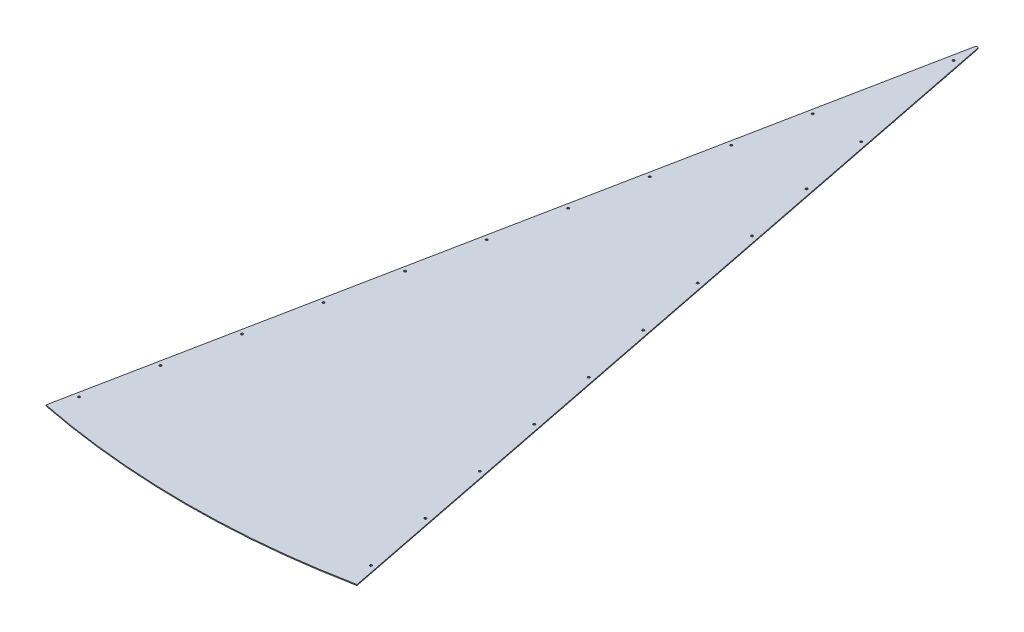
ISO-10303-21;
HEADER;
FILE_DESCRIPTION(('STEP AP214'),'2;1');
FILE_NAME('part.step','',(''),(''),'','','');
FILE_SCHEMA(('AUTOMOTIVE_DESIGN { 1 0 10303 214 1 1 1 1 }'));
ENDSEC;
DATA;
#1=APPLICATION_CONTEXT('core data for automotive mechanical design processes');
#2=APPLICATION_PROTOCOL_DEFINITION('international standard','automotive_design',2000,#1);
#3=PRODUCT_CONTEXT('',#1,'mechanical');
#4=PRODUCT('Part','Part','',(#3));
#5=PRODUCT_RELATED_PRODUCT_CATEGORY('part','',(#4));
#6=PRODUCT_DEFINITION_FORMATION('','',#4);
#7=PRODUCT_DEFINITION_CONTEXT('part definition',#1,'design');
#8=PRODUCT_DEFINITION('design','',#6,#7);
#9=PRODUCT_DEFINITION_SHAPE('','',#8);
#10=(LENGTH_UNIT() NAMED_UNIT(*) SI_UNIT(.MILLI.,.METRE.));
#11=(NAMED_UNIT(*) PLANE_ANGLE_UNIT() SI_UNIT($,.RADIAN.));
#12=(NAMED_UNIT(*) SI_UNIT($,.STERADIAN.) SOLID_ANGLE_UNIT());
#13=UNCERTAINTY_MEASURE_WITH_UNIT(LENGTH_MEASURE(1.E-05),#10,'distance_accuracy_value','');
#14=(GEOMETRIC_REPRESENTATION_CONTEXT(3) GLOBAL_UNCERTAINTY_ASSIGNED_CONTEXT((#13)) GLOBAL_UNIT_ASSIGNED_CONTEXT((#10,
#11,#12)) REPRESENTATION_CONTEXT('',''));
#15=CARTESIAN_POINT('',(0.,0.,0.));
#16=DIRECTION('',(0.,0.,1.));
#17=DIRECTION('',(1.,0.,0.));
#18=AXIS2_PLACEMENT_3D('',#15,#16,#17);
#19=CARTESIAN_POINT('',(0.,2.5,0.));
#20=DIRECTION('',(0.,-1.,0.));
#21=DIRECTION('',(0.,0.,-1.));
#22=AXIS2_PLACEMENT_3D('',#19,#20,#21);
#23=CYLINDRICAL_SURFACE('',#22,2150.);
#24=CARTESIAN_POINT('',(0.,0.,0.));
#25=DIRECTION('',(0.,1.,0.));
#26=DIRECTION('',(0.,0.,1.));
#27=AXIS2_PLACEMENT_3D('',#24,#25,#26);
#28=CIRCLE('',#27,2150.);
#29=CARTESIAN_POINT('',(-419.444192334677,0.,2108.68835286695));
#30=VERTEX_POINT('',#29);
#31=CARTESIAN_POINT('',(419.444192334677,0.,2108.68835286695));
#32=VERTEX_POINT('',#31);
#33=EDGE_CURVE('E97',#30,#32,#28,.T.);
#34=ORIENTED_EDGE('',*,*,#33,.T.);
#35=DIRECTION('',(0.,-1.,0.));
#36=VECTOR('',#35,1.);
#37=CARTESIAN_POINT('',(419.444192334677,2.5,2108.68835286695));
#38=LINE('',#37,#36);
#39=CARTESIAN_POINT('',(419.444192334677,2.5,2108.68835286695));
#40=VERTEX_POINT('',#39);
#41=EDGE_CURVE('E11',#40,#32,#38,.T.);
#42=ORIENTED_EDGE('',*,*,#41,.F.);
#43=CARTESIAN_POINT('',(0.,2.5,0.));
#44=DIRECTION('',(0.,1.,0.));
#45=DIRECTION('',(0.,0.,1.));
#46=AXIS2_PLACEMENT_3D('',#43,#44,#45);
#47=CIRCLE('',#46,2150.);
#48=CARTESIAN_POINT('',(-419.444192334677,2.5,2108.68835286695));
#49=VERTEX_POINT('',#48);
#50=EDGE_CURVE('E85',#49,#40,#47,.T.);
#51=ORIENTED_EDGE('',*,*,#50,.F.);
#52=DIRECTION('',(0.,-1.,0.));
#53=VECTOR('',#52,1.);
#54=CARTESIAN_POINT('',(-419.444192334677,2.5,2108.68835286695));
#55=LINE('',#54,#53);
#56=EDGE_CURVE('E93',#49,#30,#55,.T.);
#57=ORIENTED_EDGE('',*,*,#56,.T.);
#58=EDGE_LOOP('',(#34,#42,#51,#57));
#59=FACE_BOUND('',#58,.T.);
#60=ADVANCED_FACE('F34',(#59),#23,.T.);
#61=CARTESIAN_POINT('',(3.76904625396577,2.5,18.9482750802111));
#62=DIRECTION('',(-0.98078528040323,0.,0.195090322016129));
#63=DIRECTION('',(0.195090322016129,0.,0.98078528040323));
#64=AXIS2_PLACEMENT_3D('',#61,#62,#63);
#65=PLANE('',#64);
#66=DIRECTION('',(-0.195090322016129,0.,-0.98078528040323));
#67=VECTOR('',#66,1.);
#68=CARTESIAN_POINT('',(3.76904625396577,0.,18.9482750802111));
#69=LINE('',#68,#67);
#70=CARTESIAN_POINT('',(3.76904625396577,0.,18.9482750802111));
#71=VERTEX_POINT('',#70);
#72=EDGE_CURVE('E89',#32,#71,#69,.T.);
#73=ORIENTED_EDGE('',*,*,#72,.T.);
#74=DIRECTION('',(0.,-1.,0.));
#75=VECTOR('',#74,1.);
#76=CARTESIAN_POINT('',(3.76904625396577,2.5,18.9482750802111));
#77=LINE('',#76,#75);
#78=CARTESIAN_POINT('',(3.76904625396577,2.5,18.9482750802111));
#79=VERTEX_POINT('',#78);
#80=EDGE_CURVE('E42',#79,#71,#77,.T.);
#81=ORIENTED_EDGE('',*,*,#80,.F.);
#82=DIRECTION('',(-0.195090322016129,0.,-0.98078528040323));
#83=VECTOR('',#82,1.);
#84=CARTESIAN_POINT('',(3.76904625396577,2.5,18.9482750802111));
#85=LINE('',#84,#83);
#86=EDGE_CURVE('E80',#40,#79,#85,.T.);
#87=ORIENTED_EDGE('',*,*,#86,.F.);
#88=ORIENTED_EDGE('',*,*,#41,.T.);
#89=EDGE_LOOP('',(#73,#81,#87,#88));
#90=FACE_BOUND('',#89,.T.);
#91=ADVANCED_FACE('F88',(#90),#65,.F.);
#92=CARTESIAN_POINT('',(0.,2.5,20.));
#93=DIRECTION('',(0.,-1.,0.));
#94=DIRECTION('',(0.,0.,-1.));
#95=AXIS2_PLACEMENT_3D('',#92,#93,#94);
#96=CYLINDRICAL_SURFACE('',#95,3.91303398546939);
#97=CARTESIAN_POINT('',(0.,0.,20.));
#98=DIRECTION('',(0.,1.,0.));
#99=DIRECTION('',(0.,0.,-1.));
#100=AXIS2_PLACEMENT_3D('',#97,#98,#99);
#101=CIRCLE('',#100,3.91303398546939);
#102=CARTESIAN_POINT('',(-3.76904625396577,0.,18.9482750802111));
#103=VERTEX_POINT('',#102);
#104=EDGE_CURVE('E67',#71,#103,#101,.T.);
#105=ORIENTED_EDGE('',*,*,#104,.T.);
#106=DIRECTION('',(0.,-1.,0.));
#107=VECTOR('',#106,1.);
#108=CARTESIAN_POINT('',(-3.76904625396577,2.5,18.9482750802111));
#109=LINE('',#108,#107);
#110=CARTESIAN_POINT('',(-3.76904625396577,2.5,18.9482750802111));
#111=VERTEX_POINT('',#110);
#112=EDGE_CURVE('E90',#111,#103,#109,.T.);
#113=ORIENTED_EDGE('',*,*,#112,.F.);
#114=CARTESIAN_POINT('',(0.,2.5,20.));
#115=DIRECTION('',(0.,1.,0.));
#116=DIRECTION('',(0.,0.,-1.));
#117=AXIS2_PLACEMENT_3D('',#114,#115,#116);
#118=CIRCLE('',#117,3.91303398546939);
#119=EDGE_CURVE('E83',#79,#111,#118,.T.);
#120=ORIENTED_EDGE('',*,*,#119,.F.);
#121=ORIENTED_EDGE('',*,*,#80,.T.);
#122=EDGE_LOOP('',(#105,#113,#120,#121));
#123=FACE_BOUND('',#122,.T.);
#124=ADVANCED_FACE('F91',(#123),#96,.T.);
#125=CARTESIAN_POINT('',(-3.76904625396577,2.5,18.9482750802111));
#126=DIRECTION('',(0.98078528040323,0.,0.195090322016129));
#127=DIRECTION('',(0.195090322016129,0.,-0.98078528040323));
#128=AXIS2_PLACEMENT_3D('',#125,#126,#127);
#129=PLANE('',#128);
#130=DIRECTION('',(-0.195090322016129,0.,0.98078528040323));
#131=VECTOR('',#130,1.);
#132=CARTESIAN_POINT('',(-3.76904625396577,0.,18.9482750802111));
#133=LINE('',#132,#131);
#134=EDGE_CURVE('E73',#103,#30,#133,.T.);
#135=ORIENTED_EDGE('',*,*,#134,.T.);
#136=ORIENTED_EDGE('',*,*,#56,.F.);
#137=DIRECTION('',(-0.195090322016129,0.,0.98078528040323));
#138=VECTOR('',#137,1.);
#139=CARTESIAN_POINT('',(-3.76904625396577,2.5,18.9482750802111));
#140=LINE('',#139,#138);
#141=EDGE_CURVE('E50',#111,#49,#140,.T.);
#142=ORIENTED_EDGE('',*,*,#141,.F.);
#143=ORIENTED_EDGE('',*,*,#112,.T.);
#144=EDGE_LOOP('',(#135,#136,#142,#143));
#145=FACE_BOUND('',#144,.T.);
#146=ADVANCED_FACE('F105',(#145),#129,.F.);
#147=CARTESIAN_POINT('',(0.,2.5,0.));
#148=DIRECTION('',(0.,1.,0.));
#149=DIRECTION('',(0.,0.,1.));
#150=AXIS2_PLACEMENT_3D('',#147,#148,#149);
#151=PLANE('',#150);
#152=CARTESIAN_POINT('',(-393.622932114354,2.5,2045.51191326614));
#153=DIRECTION('',(0.,1.,0.));
#154=DIRECTION('',(0.,0.,1.));
#155=AXIS2_PLACEMENT_3D('',#152,#153,#154);
#156=CIRCLE('',#155,2.99999999999972);
#157=CARTESIAN_POINT('',(-393.622932114354,2.5,2048.51191326614));
#158=VERTEX_POINT('',#157);
#159=EDGE_CURVE('E206',#158,#158,#156,.T.);
#160=ORIENTED_EDGE('',*,*,#159,.F.);
#161=EDGE_LOOP('',(#160));
#162=FACE_BOUND('',#161,.T.);
#163=CARTESIAN_POINT('',(320.659151680324,2.5,1678.69821839533));
#164=DIRECTION('',(0.,1.,0.));
#165=DIRECTION('',(0.,0.,-1.));
#166=AXIS2_PLACEMENT_3D('',#163,#164,#165);
#167=CIRCLE('',#166,2.99999999999989);
#168=CARTESIAN_POINT('',(320.659151680324,2.5,1675.69821839533));
#169=VERTEX_POINT('',#168);
#170=EDGE_CURVE('E212',#169,#169,#167,.T.);
#171=ORIENTED_EDGE('',*,*,#170,.F.);
#172=EDGE_LOOP('',(#171));
#173=FACE_BOUND('',#172,.T.);
#174=CARTESIAN_POINT('',(357.141041897339,2.5,1862.10506583073));
#175=DIRECTION('',(0.,1.,0.));
#176=DIRECTION('',(0.,0.,-1.));
#177=AXIS2_PLACEMENT_3D('',#174,#175,#176);
#178=CIRCLE('',#177,2.99999999999989);
#179=CARTESIAN_POINT('',(357.141041897339,2.5,1859.10506583073));
#180=VERTEX_POINT('',#179);
#181=EDGE_CURVE('E213',#180,#180,#178,.T.);
#182=ORIENTED_EDGE('',*,*,#181,.F.);
#183=EDGE_LOOP('',(#182));
#184=FACE_BOUND('',#183,.T.);
#185=CARTESIAN_POINT('',(393.622932114355,2.5,2045.51191326614));
#186=DIRECTION('',(0.,1.,0.));
#187=DIRECTION('',(0.,0.,-1.));
#188=AXIS2_PLACEMENT_3D('',#185,#186,#187);
#189=CIRCLE('',#188,2.99999999999972);
#190=CARTESIAN_POINT('',(393.622932114355,2.5,2042.51191326614));
#191=VERTEX_POINT('',#190);
#192=EDGE_CURVE('E224',#191,#191,#189,.T.);
#193=ORIENTED_EDGE('',*,*,#192,.F.);
#194=EDGE_LOOP('',(#193));
#195=FACE_BOUND('',#194,.T.);
#196=CARTESIAN_POINT('',(0.,2.5,80.));
#197=DIRECTION('',(0.,1.,0.));
#198=DIRECTION('',(0.,0.,1.));
#199=AXIS2_PLACEMENT_3D('',#196,#197,#198);
#200=CIRCLE('',#199,3.);
#201=CARTESIAN_POINT('',(0.,2.5,83.));
#202=VERTEX_POINT('',#201);
#203=EDGE_CURVE('E225',#202,#202,#200,.T.);
#204=ORIENTED_EDGE('',*,*,#203,.F.);
#205=EDGE_LOOP('',(#204));
#206=FACE_BOUND('',#205,.T.);
#207=CARTESIAN_POINT('',(284.177261463308,2.5,1495.29137095993));
#208=DIRECTION('',(0.,1.,0.));
#209=DIRECTION('',(0.,0.,-1.));
#210=AXIS2_PLACEMENT_3D('',#207,#208,#209);
#211=CIRCLE('',#210,2.99999999999989);
#212=CARTESIAN_POINT('',(284.177261463308,2.5,1492.29137095993));
#213=VERTEX_POINT('',#212);
#214=EDGE_CURVE('E115',#213,#213,#211,.T.);
#215=ORIENTED_EDGE('',*,*,#214,.F.);
#216=EDGE_LOOP('',(#215));
#217=FACE_BOUND('',#216,.T.);
#218=CARTESIAN_POINT('',(247.695371246293,2.5,1311.88452352452));
#219=DIRECTION('',(0.,1.,0.));
#220=DIRECTION('',(0.,0.,-1.));
#221=AXIS2_PLACEMENT_3D('',#218,#219,#220);
#222=CIRCLE('',#221,2.99999999999986);
#223=CARTESIAN_POINT('',(247.695371246293,2.5,1308.88452352452));
#224=VERTEX_POINT('',#223);
#225=EDGE_CURVE('E114',#224,#224,#222,.T.);
#226=ORIENTED_EDGE('',*,*,#225,.F.);
#227=EDGE_LOOP('',(#226));
#228=FACE_BOUND('',#227,.T.);
#229=CARTESIAN_POINT('',(211.213481029277,2.5,1128.47767608912));
#230=DIRECTION('',(0.,1.,0.));
#231=DIRECTION('',(0.,0.,-1.));
#232=AXIS2_PLACEMENT_3D('',#229,#230,#231);
#233=CIRCLE('',#232,2.99999999999989);
#234=CARTESIAN_POINT('',(211.213481029277,2.5,1125.47767608912));
#235=VERTEX_POINT('',#234);
#236=EDGE_CURVE('E122',#235,#235,#233,.T.);
#237=ORIENTED_EDGE('',*,*,#236,.F.);
#238=EDGE_LOOP('',(#237));
#239=FACE_BOUND('',#238,.T.);
#240=CARTESIAN_POINT('',(174.731590812262,2.5,945.070828653713));
#241=DIRECTION('',(0.,1.,0.));
#242=DIRECTION('',(0.,0.,-1.));
#243=AXIS2_PLACEMENT_3D('',#240,#241,#242);
#244=CIRCLE('',#243,2.99999999999989);
#245=CARTESIAN_POINT('',(174.731590812262,2.5,942.070828653713));
#246=VERTEX_POINT('',#245);
#247=EDGE_CURVE('E128',#246,#246,#244,.T.);
#248=ORIENTED_EDGE('',*,*,#247,.F.);
#249=EDGE_LOOP('',(#248));
#250=FACE_BOUND('',#249,.T.);
#251=CARTESIAN_POINT('',(138.249700595246,2.5,761.663981218309));
#252=DIRECTION('',(0.,1.,0.));
#253=DIRECTION('',(0.,0.,-1.));
#254=AXIS2_PLACEMENT_3D('',#251,#252,#253);
#255=CIRCLE('',#254,2.99999999999992);
#256=CARTESIAN_POINT('',(138.249700595246,2.5,758.663981218309));
#257=VERTEX_POINT('',#256);
#258=EDGE_CURVE('E134',#257,#257,#255,.T.);
#259=ORIENTED_EDGE('',*,*,#258,.F.);
#260=EDGE_LOOP('',(#259));
#261=FACE_BOUND('',#260,.T.);
#262=CARTESIAN_POINT('',(101.767810378231,2.5,578.257133782905));
#263=DIRECTION('',(0.,1.,0.));
#264=DIRECTION('',(0.,0.,-1.));
#265=AXIS2_PLACEMENT_3D('',#262,#263,#264);
#266=CIRCLE('',#265,2.99999999999993);
#267=CARTESIAN_POINT('',(101.767810378231,2.5,575.257133782905));
#268=VERTEX_POINT('',#267);
#269=EDGE_CURVE('E140',#268,#268,#266,.T.);
#270=ORIENTED_EDGE('',*,*,#269,.F.);
#271=EDGE_LOOP('',(#270));
#272=FACE_BOUND('',#271,.T.);
#273=CARTESIAN_POINT('',(65.2859201612153,2.5,394.850286347501));
#274=DIRECTION('',(0.,1.,0.));
#275=DIRECTION('',(0.,0.,-1.));
#276=AXIS2_PLACEMENT_3D('',#273,#274,#275);
#277=CIRCLE('',#276,2.99999999999986);
#278=CARTESIAN_POINT('',(65.2859201612153,2.5,391.850286347501));
#279=VERTEX_POINT('',#278);
#280=EDGE_CURVE('E146',#279,#279,#277,.T.);
#281=ORIENTED_EDGE('',*,*,#280,.F.);
#282=EDGE_LOOP('',(#281));
#283=FACE_BOUND('',#282,.T.);
#284=CARTESIAN_POINT('',(-65.2859201612153,2.5,394.850286347501));
#285=DIRECTION('',(0.,1.,0.));
#286=DIRECTION('',(0.,0.,1.));
#287=AXIS2_PLACEMENT_3D('',#284,#285,#286);
#288=CIRCLE('',#287,2.99999999999984);
#289=CARTESIAN_POINT('',(-65.2859201612153,2.5,397.8502863475));
#290=VERTEX_POINT('',#289);
#291=EDGE_CURVE('E152',#290,#290,#288,.T.);
#292=ORIENTED_EDGE('',*,*,#291,.F.);
#293=EDGE_LOOP('',(#292));
#294=FACE_BOUND('',#293,.T.);
#295=CARTESIAN_POINT('',(-101.767810378231,2.5,578.257133782905));
#296=DIRECTION('',(0.,1.,0.));
#297=DIRECTION('',(0.,0.,1.));
#298=AXIS2_PLACEMENT_3D('',#295,#296,#297);
#299=CIRCLE('',#298,2.99999999999993);
#300=CARTESIAN_POINT('',(-101.767810378231,2.5,581.257133782905));
#301=VERTEX_POINT('',#300);
#302=EDGE_CURVE('E158',#301,#301,#299,.T.);
#303=ORIENTED_EDGE('',*,*,#302,.F.);
#304=EDGE_LOOP('',(#303));
#305=FACE_BOUND('',#304,.T.);
#306=CARTESIAN_POINT('',(-138.249700595246,2.5,761.663981218309));
#307=DIRECTION('',(0.,1.,0.));
#308=DIRECTION('',(0.,0.,1.));
#309=AXIS2_PLACEMENT_3D('',#306,#307,#308);
#310=CIRCLE('',#309,2.99999999999992);
#311=CARTESIAN_POINT('',(-138.249700595246,2.5,764.663981218309));
#312=VERTEX_POINT('',#311);
#313=EDGE_CURVE('E164',#312,#312,#310,.T.);
#314=ORIENTED_EDGE('',*,*,#313,.F.);
#315=EDGE_LOOP('',(#314));
#316=FACE_BOUND('',#315,.T.);
#317=CARTESIAN_POINT('',(-174.731590812262,2.5,945.070828653713));
#318=DIRECTION('',(0.,1.,0.));
#319=DIRECTION('',(0.,0.,1.));
#320=AXIS2_PLACEMENT_3D('',#317,#318,#319);
#321=CIRCLE('',#320,2.99999999999989);
#322=CARTESIAN_POINT('',(-174.731590812262,2.5,948.070828653713));
#323=VERTEX_POINT('',#322);
#324=EDGE_CURVE('E170',#323,#323,#321,.T.);
#325=ORIENTED_EDGE('',*,*,#324,.F.);
#326=EDGE_LOOP('',(#325));
#327=FACE_BOUND('',#326,.T.);
#328=CARTESIAN_POINT('',(-211.213481029277,2.5,1128.47767608912));
#329=DIRECTION('',(0.,1.,0.));
#330=DIRECTION('',(0.,0.,1.));
#331=AXIS2_PLACEMENT_3D('',#328,#329,#330);
#332=CIRCLE('',#331,2.99999999999989);
#333=CARTESIAN_POINT('',(-211.213481029277,2.5,1131.47767608912));
#334=VERTEX_POINT('',#333);
#335=EDGE_CURVE('E176',#334,#334,#332,.T.);
#336=ORIENTED_EDGE('',*,*,#335,.F.);
#337=EDGE_LOOP('',(#336));
#338=FACE_BOUND('',#337,.T.);
#339=CARTESIAN_POINT('',(-247.695371246292,2.5,1311.88452352452));
#340=DIRECTION('',(0.,1.,0.));
#341=DIRECTION('',(0.,0.,1.));
#342=AXIS2_PLACEMENT_3D('',#339,#340,#341);
#343=CIRCLE('',#342,2.99999999999989);
#344=CARTESIAN_POINT('',(-247.695371246292,2.5,1314.88452352452));
#345=VERTEX_POINT('',#344);
#346=EDGE_CURVE('E182',#345,#345,#343,.T.);
#347=ORIENTED_EDGE('',*,*,#346,.F.);
#348=EDGE_LOOP('',(#347));
#349=FACE_BOUND('',#348,.T.);
#350=CARTESIAN_POINT('',(-284.177261463308,2.5,1495.29137095993));
#351=DIRECTION('',(0.,1.,0.));
#352=DIRECTION('',(0.,0.,1.));
#353=AXIS2_PLACEMENT_3D('',#350,#351,#352);
#354=CIRCLE('',#353,2.99999999999989);
#355=CARTESIAN_POINT('',(-284.177261463308,2.5,1498.29137095993));
#356=VERTEX_POINT('',#355);
#357=EDGE_CURVE('E188',#356,#356,#354,.T.);
#358=ORIENTED_EDGE('',*,*,#357,.F.);
#359=EDGE_LOOP('',(#358));
#360=FACE_BOUND('',#359,.T.);
#361=CARTESIAN_POINT('',(-320.659151680323,2.5,1678.69821839533));
#362=DIRECTION('',(0.,1.,0.));
#363=DIRECTION('',(0.,0.,1.));
#364=AXIS2_PLACEMENT_3D('',#361,#362,#363);
#365=CIRCLE('',#364,2.99999999999989);
#366=CARTESIAN_POINT('',(-320.659151680323,2.5,1681.69821839533));
#367=VERTEX_POINT('',#366);
#368=EDGE_CURVE('E194',#367,#367,#365,.T.);
#369=ORIENTED_EDGE('',*,*,#368,.F.);
#370=EDGE_LOOP('',(#369));
#371=FACE_BOUND('',#370,.T.);
#372=CARTESIAN_POINT('',(-357.141041897339,2.5,1862.10506583073));
#373=DIRECTION('',(0.,1.,0.));
#374=DIRECTION('',(0.,0.,1.));
#375=AXIS2_PLACEMENT_3D('',#372,#373,#374);
#376=CIRCLE('',#375,2.99999999999989);
#377=CARTESIAN_POINT('',(-357.141041897339,2.5,1865.10506583073));
#378=VERTEX_POINT('',#377);
#379=EDGE_CURVE('E200',#378,#378,#376,.T.);
#380=ORIENTED_EDGE('',*,*,#379,.F.);
#381=EDGE_LOOP('',(#380));
#382=FACE_BOUND('',#381,.T.);
#383=ORIENTED_EDGE('',*,*,#50,.T.);
#384=ORIENTED_EDGE('',*,*,#86,.T.);
#385=ORIENTED_EDGE('',*,*,#119,.T.);
#386=ORIENTED_EDGE('',*,*,#141,.T.);
#387=EDGE_LOOP('',(#383,#384,#385,#386));
#388=FACE_BOUND('',#387,.T.);
#389=ADVANCED_FACE('F81',(#162,#173,#184,#195,#206,#217,#228,#239,#250,#261,#272,#283,#294,#305,
#316,#327,#338,#349,#360,#371,#382,#388),#151,.T.);
#390=CARTESIAN_POINT('',(0.,0.,0.));
#391=DIRECTION('',(0.,1.,0.));
#392=DIRECTION('',(0.,0.,1.));
#393=AXIS2_PLACEMENT_3D('',#390,#391,#392);
#394=PLANE('',#393);
#395=CARTESIAN_POINT('',(-393.622932114354,0.,2045.51191326614));
#396=DIRECTION('',(0.,1.,0.));
#397=DIRECTION('',(0.,0.,1.));
#398=AXIS2_PLACEMENT_3D('',#395,#396,#397);
#399=CIRCLE('',#398,2.99999999999972);
#400=CARTESIAN_POINT('',(-393.622932114354,0.,2048.51191326614));
#401=VERTEX_POINT('',#400);
#402=EDGE_CURVE('E100',#401,#401,#399,.F.);
#403=ORIENTED_EDGE('',*,*,#402,.F.);
#404=EDGE_LOOP('',(#403));
#405=FACE_BOUND('',#404,.T.);
#406=CARTESIAN_POINT('',(320.659151680324,0.,1678.69821839533));
#407=DIRECTION('',(0.,1.,0.));
#408=DIRECTION('',(0.,0.,1.));
#409=AXIS2_PLACEMENT_3D('',#406,#407,#408);
#410=CIRCLE('',#409,2.99999999999989);
#411=CARTESIAN_POINT('',(320.659151680324,0.,1681.69821839533));
#412=VERTEX_POINT('',#411);
#413=EDGE_CURVE('E118',#412,#412,#410,.F.);
#414=ORIENTED_EDGE('',*,*,#413,.F.);
#415=EDGE_LOOP('',(#414));
#416=FACE_BOUND('',#415,.T.);
#417=CARTESIAN_POINT('',(357.141041897339,0.,1862.10506583073));
#418=DIRECTION('',(0.,1.,0.));
#419=DIRECTION('',(0.,0.,1.));
#420=AXIS2_PLACEMENT_3D('',#417,#418,#419);
#421=CIRCLE('',#420,2.99999999999989);
#422=CARTESIAN_POINT('',(357.141041897339,0.,1865.10506583073));
#423=VERTEX_POINT('',#422);
#424=EDGE_CURVE('E209',#423,#423,#421,.F.);
#425=ORIENTED_EDGE('',*,*,#424,.F.);
#426=EDGE_LOOP('',(#425));
#427=FACE_BOUND('',#426,.T.);
#428=CARTESIAN_POINT('',(393.622932114355,0.,2045.51191326614));
#429=DIRECTION('',(0.,1.,0.));
#430=DIRECTION('',(0.,0.,1.));
#431=AXIS2_PLACEMENT_3D('',#428,#429,#430);
#432=CIRCLE('',#431,2.99999999999972);
#433=CARTESIAN_POINT('',(393.622932114355,0.,2048.51191326614));
#434=VERTEX_POINT('',#433);
#435=EDGE_CURVE('E216',#434,#434,#432,.F.);
#436=ORIENTED_EDGE('',*,*,#435,.F.);
#437=EDGE_LOOP('',(#436));
#438=FACE_BOUND('',#437,.T.);
#439=CARTESIAN_POINT('',(0.,0.,80.));
#440=DIRECTION('',(0.,1.,0.));
#441=DIRECTION('',(0.,0.,1.));
#442=AXIS2_PLACEMENT_3D('',#439,#440,#441);
#443=CIRCLE('',#442,3.);
#444=CARTESIAN_POINT('',(0.,0.,83.));
#445=VERTEX_POINT('',#444);
#446=EDGE_CURVE('E221',#445,#445,#443,.F.);
#447=ORIENTED_EDGE('',*,*,#446,.F.);
#448=EDGE_LOOP('',(#447));
#449=FACE_BOUND('',#448,.T.);
#450=CARTESIAN_POINT('',(284.177261463308,0.,1495.29137095993));
#451=DIRECTION('',(0.,1.,0.));
#452=DIRECTION('',(0.,0.,1.));
#453=AXIS2_PLACEMENT_3D('',#450,#451,#452);
#454=CIRCLE('',#453,2.99999999999989);
#455=CARTESIAN_POINT('',(284.177261463308,0.,1498.29137095993));
#456=VERTEX_POINT('',#455);
#457=EDGE_CURVE('E111',#456,#456,#454,.F.);
#458=ORIENTED_EDGE('',*,*,#457,.F.);
#459=EDGE_LOOP('',(#458));
#460=FACE_BOUND('',#459,.T.);
#461=CARTESIAN_POINT('',(247.695371246293,0.,1311.88452352452));
#462=DIRECTION('',(0.,1.,0.));
#463=DIRECTION('',(0.,0.,1.));
#464=AXIS2_PLACEMENT_3D('',#461,#462,#463);
#465=CIRCLE('',#464,2.99999999999986);
#466=CARTESIAN_POINT('',(247.695371246293,0.,1314.88452352452));
#467=VERTEX_POINT('',#466);
#468=EDGE_CURVE('E119',#467,#467,#465,.F.);
#469=ORIENTED_EDGE('',*,*,#468,.F.);
#470=EDGE_LOOP('',(#469));
#471=FACE_BOUND('',#470,.T.);
#472=CARTESIAN_POINT('',(211.213481029277,0.,1128.47767608912));
#473=DIRECTION('',(0.,1.,0.));
#474=DIRECTION('',(0.,0.,1.));
#475=AXIS2_PLACEMENT_3D('',#472,#473,#474);
#476=CIRCLE('',#475,2.99999999999989);
#477=CARTESIAN_POINT('',(211.213481029277,0.,1131.47767608912));
#478=VERTEX_POINT('',#477);
#479=EDGE_CURVE('E125',#478,#478,#476,.F.);
#480=ORIENTED_EDGE('',*,*,#479,.F.);
#481=EDGE_LOOP('',(#480));
#482=FACE_BOUND('',#481,.T.);
#483=CARTESIAN_POINT('',(174.731590812262,0.,945.070828653713));
#484=DIRECTION('',(0.,1.,0.));
#485=DIRECTION('',(0.,0.,1.));
#486=AXIS2_PLACEMENT_3D('',#483,#484,#485);
#487=CIRCLE('',#486,2.99999999999989);
#488=CARTESIAN_POINT('',(174.731590812262,0.,948.070828653713));
#489=VERTEX_POINT('',#488);
#490=EDGE_CURVE('E131',#489,#489,#487,.F.);
#491=ORIENTED_EDGE('',*,*,#490,.F.);
#492=EDGE_LOOP('',(#491));
#493=FACE_BOUND('',#492,.T.);
#494=CARTESIAN_POINT('',(138.249700595246,0.,761.663981218309));
#495=DIRECTION('',(0.,1.,0.));
#496=DIRECTION('',(0.,0.,1.));
#497=AXIS2_PLACEMENT_3D('',#494,#495,#496);
#498=CIRCLE('',#497,2.99999999999992);
#499=CARTESIAN_POINT('',(138.249700595246,0.,764.663981218309));
#500=VERTEX_POINT('',#499);
#501=EDGE_CURVE('E137',#500,#500,#498,.F.);
#502=ORIENTED_EDGE('',*,*,#501,.F.);
#503=EDGE_LOOP('',(#502));
#504=FACE_BOUND('',#503,.T.);
#505=CARTESIAN_POINT('',(101.767810378231,0.,578.257133782905));
#506=DIRECTION('',(0.,1.,0.));
#507=DIRECTION('',(0.,0.,1.));
#508=AXIS2_PLACEMENT_3D('',#505,#506,#507);
#509=CIRCLE('',#508,2.99999999999993);
#510=CARTESIAN_POINT('',(101.767810378231,0.,581.257133782905));
#511=VERTEX_POINT('',#510);
#512=EDGE_CURVE('E143',#511,#511,#509,.F.);
#513=ORIENTED_EDGE('',*,*,#512,.F.);
#514=EDGE_LOOP('',(#513));
#515=FACE_BOUND('',#514,.T.);
#516=CARTESIAN_POINT('',(65.2859201612153,0.,394.850286347501));
#517=DIRECTION('',(0.,1.,0.));
#518=DIRECTION('',(0.,0.,1.));
#519=AXIS2_PLACEMENT_3D('',#516,#517,#518);
#520=CIRCLE('',#519,2.99999999999986);
#521=CARTESIAN_POINT('',(65.2859201612153,0.,397.8502863475));
#522=VERTEX_POINT('',#521);
#523=EDGE_CURVE('E149',#522,#522,#520,.F.);
#524=ORIENTED_EDGE('',*,*,#523,.F.);
#525=EDGE_LOOP('',(#524));
#526=FACE_BOUND('',#525,.T.);
#527=CARTESIAN_POINT('',(-65.2859201612153,0.,394.850286347501));
#528=DIRECTION('',(0.,1.,0.));
#529=DIRECTION('',(0.,0.,1.));
#530=AXIS2_PLACEMENT_3D('',#527,#528,#529);
#531=CIRCLE('',#530,2.99999999999984);
#532=CARTESIAN_POINT('',(-65.2859201612153,0.,397.8502863475));
#533=VERTEX_POINT('',#532);
#534=EDGE_CURVE('E155',#533,#533,#531,.F.);
#535=ORIENTED_EDGE('',*,*,#534,.F.);
#536=EDGE_LOOP('',(#535));
#537=FACE_BOUND('',#536,.T.);
#538=CARTESIAN_POINT('',(-101.767810378231,0.,578.257133782905));
#539=DIRECTION('',(0.,1.,0.));
#540=DIRECTION('',(0.,0.,1.));
#541=AXIS2_PLACEMENT_3D('',#538,#539,#540);
#542=CIRCLE('',#541,2.99999999999993);
#543=CARTESIAN_POINT('',(-101.767810378231,0.,581.257133782905));
#544=VERTEX_POINT('',#543);
#545=EDGE_CURVE('E161',#544,#544,#542,.F.);
#546=ORIENTED_EDGE('',*,*,#545,.F.);
#547=EDGE_LOOP('',(#546));
#548=FACE_BOUND('',#547,.T.);
#549=CARTESIAN_POINT('',(-138.249700595246,0.,761.663981218309));
#550=DIRECTION('',(0.,1.,0.));
#551=DIRECTION('',(0.,0.,1.));
#552=AXIS2_PLACEMENT_3D('',#549,#550,#551);
#553=CIRCLE('',#552,2.99999999999992);
#554=CARTESIAN_POINT('',(-138.249700595246,0.,764.663981218309));
#555=VERTEX_POINT('',#554);
#556=EDGE_CURVE('E167',#555,#555,#553,.F.);
#557=ORIENTED_EDGE('',*,*,#556,.F.);
#558=EDGE_LOOP('',(#557));
#559=FACE_BOUND('',#558,.T.);
#560=CARTESIAN_POINT('',(-174.731590812262,0.,945.070828653713));
#561=DIRECTION('',(0.,1.,0.));
#562=DIRECTION('',(0.,0.,1.));
#563=AXIS2_PLACEMENT_3D('',#560,#561,#562);
#564=CIRCLE('',#563,2.99999999999989);
#565=CARTESIAN_POINT('',(-174.731590812262,0.,948.070828653713));
#566=VERTEX_POINT('',#565);
#567=EDGE_CURVE('E173',#566,#566,#564,.F.);
#568=ORIENTED_EDGE('',*,*,#567,.F.);
#569=EDGE_LOOP('',(#568));
#570=FACE_BOUND('',#569,.T.);
#571=CARTESIAN_POINT('',(-211.213481029277,0.,1128.47767608912));
#572=DIRECTION('',(0.,1.,0.));
#573=DIRECTION('',(0.,0.,1.));
#574=AXIS2_PLACEMENT_3D('',#571,#572,#573);
#575=CIRCLE('',#574,2.99999999999989);
#576=CARTESIAN_POINT('',(-211.213481029277,0.,1131.47767608912));
#577=VERTEX_POINT('',#576);
#578=EDGE_CURVE('E179',#577,#577,#575,.F.);
#579=ORIENTED_EDGE('',*,*,#578,.F.);
#580=EDGE_LOOP('',(#579));
#581=FACE_BOUND('',#580,.T.);
#582=CARTESIAN_POINT('',(-247.695371246292,0.,1311.88452352452));
#583=DIRECTION('',(0.,1.,0.));
#584=DIRECTION('',(0.,0.,1.));
#585=AXIS2_PLACEMENT_3D('',#582,#583,#584);
#586=CIRCLE('',#585,2.99999999999989);
#587=CARTESIAN_POINT('',(-247.695371246292,0.,1314.88452352452));
#588=VERTEX_POINT('',#587);
#589=EDGE_CURVE('E185',#588,#588,#586,.F.);
#590=ORIENTED_EDGE('',*,*,#589,.F.);
#591=EDGE_LOOP('',(#590));
#592=FACE_BOUND('',#591,.T.);
#593=CARTESIAN_POINT('',(-284.177261463308,0.,1495.29137095993));
#594=DIRECTION('',(0.,1.,0.));
#595=DIRECTION('',(0.,0.,1.));
#596=AXIS2_PLACEMENT_3D('',#593,#594,#595);
#597=CIRCLE('',#596,2.99999999999989);
#598=CARTESIAN_POINT('',(-284.177261463308,0.,1498.29137095993));
#599=VERTEX_POINT('',#598);
#600=EDGE_CURVE('E191',#599,#599,#597,.F.);
#601=ORIENTED_EDGE('',*,*,#600,.F.);
#602=EDGE_LOOP('',(#601));
#603=FACE_BOUND('',#602,.T.);
#604=CARTESIAN_POINT('',(-320.659151680323,0.,1678.69821839533));
#605=DIRECTION('',(0.,1.,0.));
#606=DIRECTION('',(0.,0.,1.));
#607=AXIS2_PLACEMENT_3D('',#604,#605,#606);
#608=CIRCLE('',#607,2.99999999999989);
#609=CARTESIAN_POINT('',(-320.659151680323,0.,1681.69821839533));
#610=VERTEX_POINT('',#609);
#611=EDGE_CURVE('E197',#610,#610,#608,.F.);
#612=ORIENTED_EDGE('',*,*,#611,.F.);
#613=EDGE_LOOP('',(#612));
#614=FACE_BOUND('',#613,.T.);
#615=CARTESIAN_POINT('',(-357.141041897339,0.,1862.10506583073));
#616=DIRECTION('',(0.,1.,0.));
#617=DIRECTION('',(0.,0.,1.));
#618=AXIS2_PLACEMENT_3D('',#615,#616,#617);
#619=CIRCLE('',#618,2.99999999999989);
#620=CARTESIAN_POINT('',(-357.141041897339,0.,1865.10506583073));
#621=VERTEX_POINT('',#620);
#622=EDGE_CURVE('E203',#621,#621,#619,.F.);
#623=ORIENTED_EDGE('',*,*,#622,.F.);
#624=EDGE_LOOP('',(#623));
#625=FACE_BOUND('',#624,.T.);
#626=ORIENTED_EDGE('',*,*,#33,.F.);
#627=ORIENTED_EDGE('',*,*,#134,.F.);
#628=ORIENTED_EDGE('',*,*,#104,.F.);
#629=ORIENTED_EDGE('',*,*,#72,.F.);
#630=EDGE_LOOP('',(#626,#627,#628,#629));
#631=FACE_BOUND('',#630,.T.);
#632=ADVANCED_FACE('F108',(#405,#416,#427,#438,#449,#460,#471,#482,#493,#504,#515,#526,#537,
#548,#559,#570,#581,#592,#603,#614,#625,#631),#394,.F.);
#633=CARTESIAN_POINT('',(-357.141041897339,-8.48528137423858,1862.10506583073));
#634=DIRECTION('',(0.,1.,0.));
#635=DIRECTION('',(0.,0.,1.));
#636=AXIS2_PLACEMENT_3D('',#633,#634,#635);
#637=CYLINDRICAL_SURFACE('',#636,2.99999999999989);
#638=ORIENTED_EDGE('',*,*,#622,.T.);
#639=EDGE_LOOP('',(#638));
#640=FACE_BOUND('',#639,.T.);
#641=ORIENTED_EDGE('',*,*,#379,.T.);
#642=EDGE_LOOP('',(#641));
#643=FACE_BOUND('',#642,.T.);
#644=ADVANCED_FACE('F282',(#640,#643),#637,.F.);
#645=CARTESIAN_POINT('',(-320.659151680323,-8.48528137423858,1678.69821839533));
#646=DIRECTION('',(0.,1.,0.));
#647=DIRECTION('',(0.,0.,1.));
#648=AXIS2_PLACEMENT_3D('',#645,#646,#647);
#649=CYLINDRICAL_SURFACE('',#648,2.99999999999989);
#650=ORIENTED_EDGE('',*,*,#611,.T.);
#651=EDGE_LOOP('',(#650));
#652=FACE_BOUND('',#651,.T.);
#653=ORIENTED_EDGE('',*,*,#368,.T.);
#654=EDGE_LOOP('',(#653));
#655=FACE_BOUND('',#654,.T.);
#656=ADVANCED_FACE('F284',(#652,#655),#649,.F.);
#657=CARTESIAN_POINT('',(-284.177261463308,-8.48528137423858,1495.29137095993));
#658=DIRECTION('',(0.,1.,0.));
#659=DIRECTION('',(0.,0.,1.));
#660=AXIS2_PLACEMENT_3D('',#657,#658,#659);
#661=CYLINDRICAL_SURFACE('',#660,2.99999999999989);
#662=ORIENTED_EDGE('',*,*,#600,.T.);
#663=EDGE_LOOP('',(#662));
#664=FACE_BOUND('',#663,.T.);
#665=ORIENTED_EDGE('',*,*,#357,.T.);
#666=EDGE_LOOP('',(#665));
#667=FACE_BOUND('',#666,.T.);
#668=ADVANCED_FACE('F291',(#664,#667),#661,.F.);
#669=CARTESIAN_POINT('',(-247.695371246292,-8.48528137423858,1311.88452352452));
#670=DIRECTION('',(0.,1.,0.));
#671=DIRECTION('',(0.,0.,1.));
#672=AXIS2_PLACEMENT_3D('',#669,#670,#671);
#673=CYLINDRICAL_SURFACE('',#672,2.99999999999989);
#674=ORIENTED_EDGE('',*,*,#589,.T.);
#675=EDGE_LOOP('',(#674));
#676=FACE_BOUND('',#675,.T.);
#677=ORIENTED_EDGE('',*,*,#346,.T.);
#678=EDGE_LOOP('',(#677));
#679=FACE_BOUND('',#678,.T.);
#680=ADVANCED_FACE('F356',(#676,#679),#673,.F.);
#681=CARTESIAN_POINT('',(-211.213481029277,-8.48528137423858,1128.47767608912));
#682=DIRECTION('',(0.,1.,0.));
#683=DIRECTION('',(0.,0.,1.));
#684=AXIS2_PLACEMENT_3D('',#681,#682,#683);
#685=CYLINDRICAL_SURFACE('',#684,2.99999999999989);
#686=ORIENTED_EDGE('',*,*,#578,.T.);
#687=EDGE_LOOP('',(#686));
#688=FACE_BOUND('',#687,.T.);
#689=ORIENTED_EDGE('',*,*,#335,.T.);
#690=EDGE_LOOP('',(#689));
#691=FACE_BOUND('',#690,.T.);
#692=ADVANCED_FACE('F352',(#688,#691),#685,.F.);
#693=CARTESIAN_POINT('',(-174.731590812262,-8.48528137423858,945.070828653713));
#694=DIRECTION('',(0.,1.,0.));
#695=DIRECTION('',(0.,0.,1.));
#696=AXIS2_PLACEMENT_3D('',#693,#694,#695);
#697=CYLINDRICAL_SURFACE('',#696,2.99999999999989);
#698=ORIENTED_EDGE('',*,*,#567,.T.);
#699=EDGE_LOOP('',(#698));
#700=FACE_BOUND('',#699,.T.);
#701=ORIENTED_EDGE('',*,*,#324,.T.);
#702=EDGE_LOOP('',(#701));
#703=FACE_BOUND('',#702,.T.);
#704=ADVANCED_FACE('F348',(#700,#703),#697,.F.);
#705=CARTESIAN_POINT('',(-138.249700595246,-8.48528137423858,761.663981218309));
#706=DIRECTION('',(0.,1.,0.));
#707=DIRECTION('',(0.,0.,1.));
#708=AXIS2_PLACEMENT_3D('',#705,#706,#707);
#709=CYLINDRICAL_SURFACE('',#708,2.99999999999992);
#710=ORIENTED_EDGE('',*,*,#556,.T.);
#711=EDGE_LOOP('',(#710));
#712=FACE_BOUND('',#711,.T.);
#713=ORIENTED_EDGE('',*,*,#313,.T.);
#714=EDGE_LOOP('',(#713));
#715=FACE_BOUND('',#714,.T.);
#716=ADVANCED_FACE('F344',(#712,#715),#709,.F.);
#717=CARTESIAN_POINT('',(-101.767810378231,-8.48528137423858,578.257133782905));
#718=DIRECTION('',(0.,1.,0.));
#719=DIRECTION('',(0.,0.,1.));
#720=AXIS2_PLACEMENT_3D('',#717,#718,#719);
#721=CYLINDRICAL_SURFACE('',#720,2.99999999999993);
#722=ORIENTED_EDGE('',*,*,#545,.T.);
#723=EDGE_LOOP('',(#722));
#724=FACE_BOUND('',#723,.T.);
#725=ORIENTED_EDGE('',*,*,#302,.T.);
#726=EDGE_LOOP('',(#725));
#727=FACE_BOUND('',#726,.T.);
#728=ADVANCED_FACE('F340',(#724,#727),#721,.F.);
#729=CARTESIAN_POINT('',(-65.2859201612153,-8.48528137423858,394.850286347501));
#730=DIRECTION('',(0.,1.,0.));
#731=DIRECTION('',(0.,0.,1.));
#732=AXIS2_PLACEMENT_3D('',#729,#730,#731);
#733=CYLINDRICAL_SURFACE('',#732,2.99999999999984);
#734=ORIENTED_EDGE('',*,*,#534,.T.);
#735=EDGE_LOOP('',(#734));
#736=FACE_BOUND('',#735,.T.);
#737=ORIENTED_EDGE('',*,*,#291,.T.);
#738=EDGE_LOOP('',(#737));
#739=FACE_BOUND('',#738,.T.);
#740=ADVANCED_FACE('F336',(#736,#739),#733,.F.);
#741=CARTESIAN_POINT('',(65.2859201612153,-8.48528137423858,394.850286347501));
#742=DIRECTION('',(0.,1.,0.));
#743=DIRECTION('',(0.,0.,1.));
#744=AXIS2_PLACEMENT_3D('',#741,#742,#743);
#745=CYLINDRICAL_SURFACE('',#744,2.99999999999986);
#746=ORIENTED_EDGE('',*,*,#523,.T.);
#747=EDGE_LOOP('',(#746));
#748=FACE_BOUND('',#747,.T.);
#749=ORIENTED_EDGE('',*,*,#280,.T.);
#750=EDGE_LOOP('',(#749));
#751=FACE_BOUND('',#750,.T.);
#752=ADVANCED_FACE('F332',(#748,#751),#745,.F.);
#753=CARTESIAN_POINT('',(101.767810378231,-8.48528137423858,578.257133782905));
#754=DIRECTION('',(0.,1.,0.));
#755=DIRECTION('',(0.,0.,1.));
#756=AXIS2_PLACEMENT_3D('',#753,#754,#755);
#757=CYLINDRICAL_SURFACE('',#756,2.99999999999993);
#758=ORIENTED_EDGE('',*,*,#512,.T.);
#759=EDGE_LOOP('',(#758));
#760=FACE_BOUND('',#759,.T.);
#761=ORIENTED_EDGE('',*,*,#269,.T.);
#762=EDGE_LOOP('',(#761));
#763=FACE_BOUND('',#762,.T.);
#764=ADVANCED_FACE('F328',(#760,#763),#757,.F.);
#765=CARTESIAN_POINT('',(138.249700595246,-8.48528137423858,761.663981218309));
#766=DIRECTION('',(0.,1.,0.));
#767=DIRECTION('',(0.,0.,1.));
#768=AXIS2_PLACEMENT_3D('',#765,#766,#767);
#769=CYLINDRICAL_SURFACE('',#768,2.99999999999992);
#770=ORIENTED_EDGE('',*,*,#501,.T.);
#771=EDGE_LOOP('',(#770));
#772=FACE_BOUND('',#771,.T.);
#773=ORIENTED_EDGE('',*,*,#258,.T.);
#774=EDGE_LOOP('',(#773));
#775=FACE_BOUND('',#774,.T.);
#776=ADVANCED_FACE('F324',(#772,#775),#769,.F.);
#777=CARTESIAN_POINT('',(174.731590812262,-8.48528137423858,945.070828653713));
#778=DIRECTION('',(0.,1.,0.));
#779=DIRECTION('',(0.,0.,1.));
#780=AXIS2_PLACEMENT_3D('',#777,#778,#779);
#781=CYLINDRICAL_SURFACE('',#780,2.99999999999989);
#782=ORIENTED_EDGE('',*,*,#490,.T.);
#783=EDGE_LOOP('',(#782));
#784=FACE_BOUND('',#783,.T.);
#785=ORIENTED_EDGE('',*,*,#247,.T.);
#786=EDGE_LOOP('',(#785));
#787=FACE_BOUND('',#786,.T.);
#788=ADVANCED_FACE('F320',(#784,#787),#781,.F.);
#789=CARTESIAN_POINT('',(211.213481029277,-8.48528137423858,1128.47767608912));
#790=DIRECTION('',(0.,1.,0.));
#791=DIRECTION('',(0.,0.,1.));
#792=AXIS2_PLACEMENT_3D('',#789,#790,#791);
#793=CYLINDRICAL_SURFACE('',#792,2.99999999999989);
#794=ORIENTED_EDGE('',*,*,#479,.T.);
#795=EDGE_LOOP('',(#794));
#796=FACE_BOUND('',#795,.T.);
#797=ORIENTED_EDGE('',*,*,#236,.T.);
#798=EDGE_LOOP('',(#797));
#799=FACE_BOUND('',#798,.T.);
#800=ADVANCED_FACE('F316',(#796,#799),#793,.F.);
#801=CARTESIAN_POINT('',(247.695371246293,-8.48528137423858,1311.88452352452));
#802=DIRECTION('',(0.,1.,0.));
#803=DIRECTION('',(0.,0.,1.));
#804=AXIS2_PLACEMENT_3D('',#801,#802,#803);
#805=CYLINDRICAL_SURFACE('',#804,2.99999999999986);
#806=ORIENTED_EDGE('',*,*,#468,.T.);
#807=EDGE_LOOP('',(#806));
#808=FACE_BOUND('',#807,.T.);
#809=ORIENTED_EDGE('',*,*,#225,.T.);
#810=EDGE_LOOP('',(#809));
#811=FACE_BOUND('',#810,.T.);
#812=ADVANCED_FACE('F312',(#808,#811),#805,.F.);
#813=CARTESIAN_POINT('',(284.177261463308,-8.48528137423858,1495.29137095993));
#814=DIRECTION('',(0.,1.,0.));
#815=DIRECTION('',(0.,0.,1.));
#816=AXIS2_PLACEMENT_3D('',#813,#814,#815);
#817=CYLINDRICAL_SURFACE('',#816,2.99999999999989);
#818=ORIENTED_EDGE('',*,*,#457,.T.);
#819=EDGE_LOOP('',(#818));
#820=FACE_BOUND('',#819,.T.);
#821=ORIENTED_EDGE('',*,*,#214,.T.);
#822=EDGE_LOOP('',(#821));
#823=FACE_BOUND('',#822,.T.);
#824=ADVANCED_FACE('F308',(#820,#823),#817,.F.);
#825=CARTESIAN_POINT('',(0.,-8.48528137423858,80.));
#826=DIRECTION('',(0.,1.,0.));
#827=DIRECTION('',(0.,0.,1.));
#828=AXIS2_PLACEMENT_3D('',#825,#826,#827);
#829=CYLINDRICAL_SURFACE('',#828,3.);
#830=ORIENTED_EDGE('',*,*,#446,.T.);
#831=EDGE_LOOP('',(#830));
#832=FACE_BOUND('',#831,.T.);
#833=ORIENTED_EDGE('',*,*,#203,.T.);
#834=EDGE_LOOP('',(#833));
#835=FACE_BOUND('',#834,.T.);
#836=ADVANCED_FACE('F311',(#832,#835),#829,.F.);
#837=CARTESIAN_POINT('',(393.622932114355,-8.48528137423858,2045.51191326614));
#838=DIRECTION('',(0.,1.,0.));
#839=DIRECTION('',(0.,0.,1.));
#840=AXIS2_PLACEMENT_3D('',#837,#838,#839);
#841=CYLINDRICAL_SURFACE('',#840,2.99999999999972);
#842=ORIENTED_EDGE('',*,*,#435,.T.);
#843=EDGE_LOOP('',(#842));
#844=FACE_BOUND('',#843,.T.);
#845=ORIENTED_EDGE('',*,*,#192,.T.);
#846=EDGE_LOOP('',(#845));
#847=FACE_BOUND('',#846,.T.);
#848=ADVANCED_FACE('F433',(#844,#847),#841,.F.);
#849=CARTESIAN_POINT('',(357.141041897339,-8.48528137423858,1862.10506583073));
#850=DIRECTION('',(0.,1.,0.));
#851=DIRECTION('',(0.,0.,1.));
#852=AXIS2_PLACEMENT_3D('',#849,#850,#851);
#853=CYLINDRICAL_SURFACE('',#852,2.99999999999989);
#854=ORIENTED_EDGE('',*,*,#424,.T.);
#855=EDGE_LOOP('',(#854));
#856=FACE_BOUND('',#855,.T.);
#857=ORIENTED_EDGE('',*,*,#181,.T.);
#858=EDGE_LOOP('',(#857));
#859=FACE_BOUND('',#858,.T.);
#860=ADVANCED_FACE('F441',(#856,#859),#853,.F.);
#861=CARTESIAN_POINT('',(320.659151680324,-8.48528137423858,1678.69821839533));
#862=DIRECTION('',(0.,1.,0.));
#863=DIRECTION('',(0.,0.,1.));
#864=AXIS2_PLACEMENT_3D('',#861,#862,#863);
#865=CYLINDRICAL_SURFACE('',#864,2.99999999999989);
#866=ORIENTED_EDGE('',*,*,#413,.T.);
#867=EDGE_LOOP('',(#866));
#868=FACE_BOUND('',#867,.T.);
#869=ORIENTED_EDGE('',*,*,#170,.T.);
#870=EDGE_LOOP('',(#869));
#871=FACE_BOUND('',#870,.T.);
#872=ADVANCED_FACE('F449',(#868,#871),#865,.F.);
#873=CARTESIAN_POINT('',(-393.622932114354,-8.48528137423858,2045.51191326614));
#874=DIRECTION('',(0.,1.,0.));
#875=DIRECTION('',(0.,0.,1.));
#876=AXIS2_PLACEMENT_3D('',#873,#874,#875);
#877=CYLINDRICAL_SURFACE('',#876,2.99999999999972);
#878=ORIENTED_EDGE('',*,*,#402,.T.);
#879=EDGE_LOOP('',(#878));
#880=FACE_BOUND('',#879,.T.);
#881=ORIENTED_EDGE('',*,*,#159,.T.);
#882=EDGE_LOOP('',(#881));
#883=FACE_BOUND('',#882,.T.);
#884=ADVANCED_FACE('F237',(#880,#883),#877,.F.);
#885=CLOSED_SHELL('',(#60,#91,#124,#146,#389,#632,#644,#656,#668,#680,#692,#704,#716,#728,#740,
#752,#764,#776,#788,#800,#812,#824,#836,#848,#860,#872,#884));
#886=MANIFOLD_SOLID_BREP('B2',#885);
#887=ADVANCED_BREP_SHAPE_REPRESENTATION('',(#18,#886),#14);
#888=SHAPE_DEFINITION_REPRESENTATION(#9,#887);
ENDSEC;
END-ISO-10303-21;
